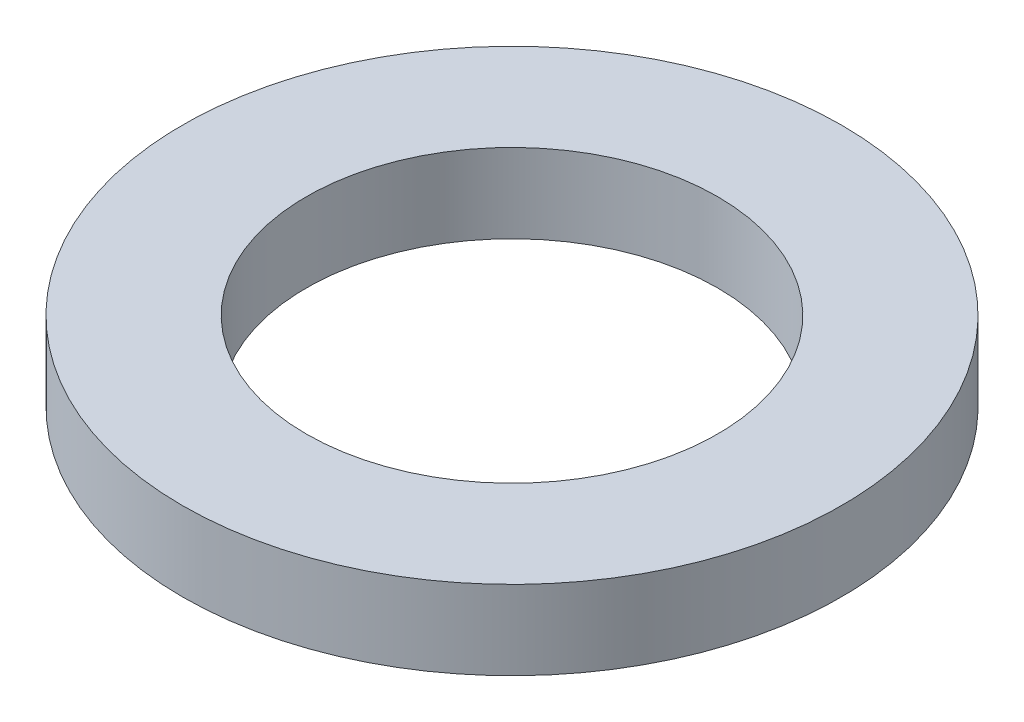
ISO-10303-21;
HEADER;
FILE_DESCRIPTION(('STEP AP214'),'2;1');
FILE_NAME('part.step','',(''),(''),'','','');
FILE_SCHEMA(('AUTOMOTIVE_DESIGN { 1 0 10303 214 1 1 1 1 }'));
ENDSEC;
DATA;
#1=APPLICATION_CONTEXT('core data for automotive mechanical design processes');
#2=APPLICATION_PROTOCOL_DEFINITION('international standard','automotive_design',2000,#1);
#3=PRODUCT_CONTEXT('',#1,'mechanical');
#4=PRODUCT('Part','Part','',(#3));
#5=PRODUCT_RELATED_PRODUCT_CATEGORY('part','',(#4));
#6=PRODUCT_DEFINITION_FORMATION('','',#4);
#7=PRODUCT_DEFINITION_CONTEXT('part definition',#1,'design');
#8=PRODUCT_DEFINITION('design','',#6,#7);
#9=PRODUCT_DEFINITION_SHAPE('','',#8);
#10=(LENGTH_UNIT() NAMED_UNIT(*) SI_UNIT(.MILLI.,.METRE.));
#11=(NAMED_UNIT(*) PLANE_ANGLE_UNIT() SI_UNIT($,.RADIAN.));
#12=(NAMED_UNIT(*) SI_UNIT($,.STERADIAN.) SOLID_ANGLE_UNIT());
#13=UNCERTAINTY_MEASURE_WITH_UNIT(LENGTH_MEASURE(1.E-05),#10,'distance_accuracy_value','');
#14=(GEOMETRIC_REPRESENTATION_CONTEXT(3) GLOBAL_UNCERTAINTY_ASSIGNED_CONTEXT((#13)) GLOBAL_UNIT_ASSIGNED_CONTEXT((#10,
#11,#12)) REPRESENTATION_CONTEXT('',''));
#15=CARTESIAN_POINT('',(0.,0.,0.));
#16=DIRECTION('',(0.,0.,1.));
#17=DIRECTION('',(1.,0.,0.));
#18=AXIS2_PLACEMENT_3D('',#15,#16,#17);
#19=CARTESIAN_POINT('',(0.,1.905,0.));
#20=DIRECTION('',(0.,-1.,0.));
#21=DIRECTION('',(0.,0.,-1.));
#22=AXIS2_PLACEMENT_3D('',#19,#20,#21);
#23=CYLINDRICAL_SURFACE('',#22,7.9375);
#24=CARTESIAN_POINT('',(0.,1.905,0.));
#25=DIRECTION('',(0.,1.,0.));
#26=DIRECTION('',(0.,0.,1.));
#27=AXIS2_PLACEMENT_3D('',#24,#25,#26);
#28=CIRCLE('',#27,7.9375);
#29=CARTESIAN_POINT('',(0.,1.905,7.9375));
#30=VERTEX_POINT('',#29);
#31=EDGE_CURVE('E10',#30,#30,#28,.T.);
#32=ORIENTED_EDGE('',*,*,#31,.F.);
#33=EDGE_LOOP('',(#32));
#34=FACE_BOUND('',#33,.T.);
#35=CARTESIAN_POINT('',(0.,0.,0.));
#36=DIRECTION('',(0.,1.,0.));
#37=DIRECTION('',(0.,0.,1.));
#38=AXIS2_PLACEMENT_3D('',#35,#36,#37);
#39=CIRCLE('',#38,7.9375);
#40=CARTESIAN_POINT('',(0.,0.,7.9375));
#41=VERTEX_POINT('',#40);
#42=EDGE_CURVE('E33',#41,#41,#39,.T.);
#43=ORIENTED_EDGE('',*,*,#42,.T.);
#44=EDGE_LOOP('',(#43));
#45=FACE_BOUND('',#44,.T.);
#46=ADVANCED_FACE('F30',(#34,#45),#23,.T.);
#47=CARTESIAN_POINT('',(0.,1.905,0.));
#48=DIRECTION('',(0.,1.,0.));
#49=DIRECTION('',(0.,0.,1.));
#50=AXIS2_PLACEMENT_3D('',#47,#48,#49);
#51=PLANE('',#50);
#52=CARTESIAN_POINT('',(0.,1.905,0.));
#53=DIRECTION('',(0.,1.,0.));
#54=DIRECTION('',(0.,0.,1.));
#55=AXIS2_PLACEMENT_3D('',#52,#53,#54);
#56=CIRCLE('',#55,4.953);
#57=CARTESIAN_POINT('',(0.,1.905,4.953));
#58=VERTEX_POINT('',#57);
#59=EDGE_CURVE('E42',#58,#58,#56,.T.);
#60=ORIENTED_EDGE('',*,*,#59,.F.);
#61=EDGE_LOOP('',(#60));
#62=FACE_BOUND('',#61,.T.);
#63=ORIENTED_EDGE('',*,*,#31,.T.);
#64=EDGE_LOOP('',(#63));
#65=FACE_BOUND('',#64,.T.);
#66=ADVANCED_FACE('F57',(#62,#65),#51,.T.);
#67=CARTESIAN_POINT('',(0.,0.,0.));
#68=DIRECTION('',(0.,1.,0.));
#69=DIRECTION('',(0.,0.,1.));
#70=AXIS2_PLACEMENT_3D('',#67,#68,#69);
#71=PLANE('',#70);
#72=CARTESIAN_POINT('',(0.,0.,0.));
#73=DIRECTION('',(0.,1.,0.));
#74=DIRECTION('',(0.,0.,1.));
#75=AXIS2_PLACEMENT_3D('',#72,#73,#74);
#76=CIRCLE('',#75,4.953);
#77=CARTESIAN_POINT('',(0.,0.,4.953));
#78=VERTEX_POINT('',#77);
#79=EDGE_CURVE('E40',#78,#78,#76,.T.);
#80=ORIENTED_EDGE('',*,*,#79,.T.);
#81=EDGE_LOOP('',(#80));
#82=FACE_BOUND('',#81,.T.);
#83=ORIENTED_EDGE('',*,*,#42,.F.);
#84=EDGE_LOOP('',(#83));
#85=FACE_BOUND('',#84,.T.);
#86=ADVANCED_FACE('F48',(#82,#85),#71,.F.);
#87=CARTESIAN_POINT('',(0.,0.,0.));
#88=DIRECTION('',(0.,1.,0.));
#89=DIRECTION('',(0.,0.,1.));
#90=AXIS2_PLACEMENT_3D('',#87,#88,#89);
#91=CYLINDRICAL_SURFACE('',#90,4.953);
#92=ORIENTED_EDGE('',*,*,#79,.F.);
#93=EDGE_LOOP('',(#92));
#94=FACE_BOUND('',#93,.T.);
#95=ORIENTED_EDGE('',*,*,#59,.T.);
#96=EDGE_LOOP('',(#95));
#97=FACE_BOUND('',#96,.T.);
#98=ADVANCED_FACE('F51',(#94,#97),#91,.F.);
#99=CLOSED_SHELL('',(#46,#66,#86,#98));
#100=MANIFOLD_SOLID_BREP('B2',#99);
#101=ADVANCED_BREP_SHAPE_REPRESENTATION('',(#18,#100),#14);
#102=SHAPE_DEFINITION_REPRESENTATION(#9,#101);
ENDSEC;
END-ISO-10303-21;
